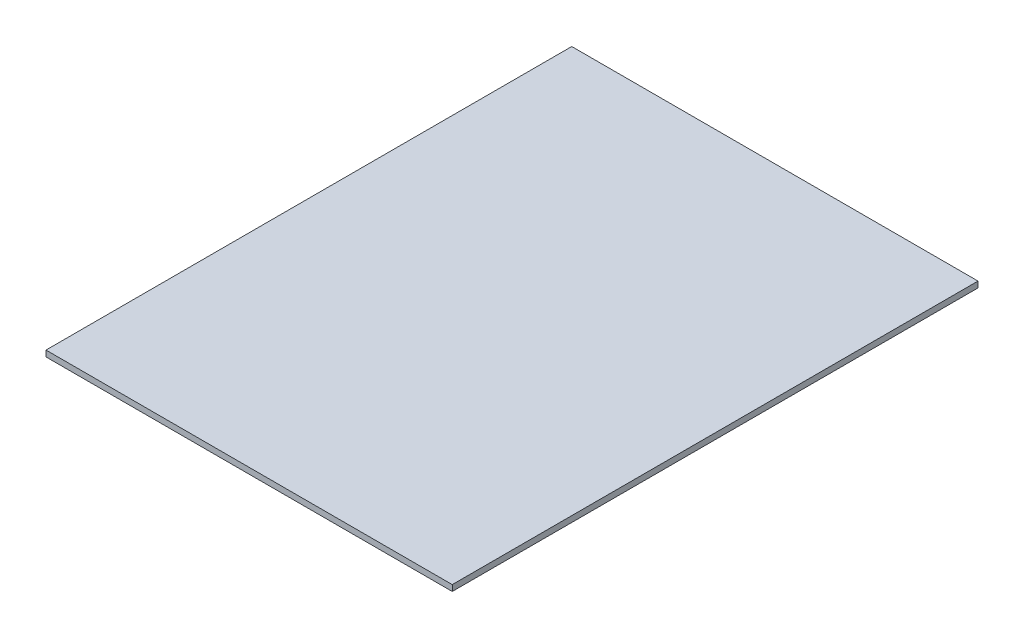
ISO-10303-21;
HEADER;
FILE_DESCRIPTION(('STEP AP214'),'2;1');
FILE_NAME('part.step','',(''),(''),'','','');
FILE_SCHEMA(('AUTOMOTIVE_DESIGN { 1 0 10303 214 1 1 1 1 }'));
ENDSEC;
DATA;
#1=APPLICATION_CONTEXT('core data for automotive mechanical design processes');
#2=APPLICATION_PROTOCOL_DEFINITION('international standard','automotive_design',2000,#1);
#3=PRODUCT_CONTEXT('',#1,'mechanical');
#4=PRODUCT('Part','Part','',(#3));
#5=PRODUCT_RELATED_PRODUCT_CATEGORY('part','',(#4));
#6=PRODUCT_DEFINITION_FORMATION('','',#4);
#7=PRODUCT_DEFINITION_CONTEXT('part definition',#1,'design');
#8=PRODUCT_DEFINITION('design','',#6,#7);
#9=PRODUCT_DEFINITION_SHAPE('','',#8);
#10=(LENGTH_UNIT() NAMED_UNIT(*) SI_UNIT(.MILLI.,.METRE.));
#11=(NAMED_UNIT(*) PLANE_ANGLE_UNIT() SI_UNIT($,.RADIAN.));
#12=(NAMED_UNIT(*) SI_UNIT($,.STERADIAN.) SOLID_ANGLE_UNIT());
#13=UNCERTAINTY_MEASURE_WITH_UNIT(LENGTH_MEASURE(1.E-05),#10,'distance_accuracy_value','');
#14=(GEOMETRIC_REPRESENTATION_CONTEXT(3) GLOBAL_UNCERTAINTY_ASSIGNED_CONTEXT((#13)) GLOBAL_UNIT_ASSIGNED_CONTEXT((#10,
#11,#12)) REPRESENTATION_CONTEXT('',''));
#15=CARTESIAN_POINT('',(0.,0.,0.));
#16=DIRECTION('',(0.,0.,1.));
#17=DIRECTION('',(1.,0.,0.));
#18=AXIS2_PLACEMENT_3D('',#15,#16,#17);
#19=CARTESIAN_POINT('',(0.,3.175,-279.4));
#20=DIRECTION('',(1.,0.,0.));
#21=DIRECTION('',(0.,0.,-1.));
#22=AXIS2_PLACEMENT_3D('',#19,#20,#21);
#23=PLANE('',#22);
#24=DIRECTION('',(0.,0.,1.));
#25=VECTOR('',#24,1.);
#26=CARTESIAN_POINT('',(0.,0.,-279.4));
#27=LINE('',#26,#25);
#28=CARTESIAN_POINT('',(0.,0.,-279.4));
#29=VERTEX_POINT('',#28);
#30=CARTESIAN_POINT('',(0.,0.,0.));
#31=VERTEX_POINT('',#30);
#32=EDGE_CURVE('E107',#29,#31,#27,.T.);
#33=ORIENTED_EDGE('',*,*,#32,.T.);
#34=DIRECTION('',(0.,-1.,0.));
#35=VECTOR('',#34,1.);
#36=CARTESIAN_POINT('',(0.,3.175,0.));
#37=LINE('',#36,#35);
#38=CARTESIAN_POINT('',(0.,3.175,0.));
#39=VERTEX_POINT('',#38);
#40=EDGE_CURVE('E11',#39,#31,#37,.T.);
#41=ORIENTED_EDGE('',*,*,#40,.F.);
#42=DIRECTION('',(0.,0.,1.));
#43=VECTOR('',#42,1.);
#44=CARTESIAN_POINT('',(0.,3.175,-279.4));
#45=LINE('',#44,#43);
#46=CARTESIAN_POINT('',(0.,3.175,-279.4));
#47=VERTEX_POINT('',#46);
#48=EDGE_CURVE('E91',#47,#39,#45,.T.);
#49=ORIENTED_EDGE('',*,*,#48,.F.);
#50=DIRECTION('',(0.,-1.,0.));
#51=VECTOR('',#50,1.);
#52=CARTESIAN_POINT('',(0.,3.175,-279.4));
#53=LINE('',#52,#51);
#54=EDGE_CURVE('E103',#47,#29,#53,.T.);
#55=ORIENTED_EDGE('',*,*,#54,.T.);
#56=EDGE_LOOP('',(#33,#41,#49,#55));
#57=FACE_BOUND('',#56,.T.);
#58=ADVANCED_FACE('F39',(#57),#23,.F.);
#59=CARTESIAN_POINT('',(0.,3.175,0.));
#60=DIRECTION('',(0.,0.,-1.));
#61=DIRECTION('',(-1.,0.,0.));
#62=AXIS2_PLACEMENT_3D('',#59,#60,#61);
#63=PLANE('',#62);
#64=DIRECTION('',(1.,0.,0.));
#65=VECTOR('',#64,1.);
#66=CARTESIAN_POINT('',(0.,0.,0.));
#67=LINE('',#66,#65);
#68=CARTESIAN_POINT('',(215.9,0.,0.));
#69=VERTEX_POINT('',#68);
#70=EDGE_CURVE('E96',#31,#69,#67,.T.);
#71=ORIENTED_EDGE('',*,*,#70,.T.);
#72=DIRECTION('',(0.,-1.,0.));
#73=VECTOR('',#72,1.);
#74=CARTESIAN_POINT('',(215.9,3.175,0.));
#75=LINE('',#74,#73);
#76=CARTESIAN_POINT('',(215.9,3.175,0.));
#77=VERTEX_POINT('',#76);
#78=EDGE_CURVE('E48',#77,#69,#75,.T.);
#79=ORIENTED_EDGE('',*,*,#78,.F.);
#80=DIRECTION('',(1.,0.,0.));
#81=VECTOR('',#80,1.);
#82=CARTESIAN_POINT('',(0.,3.175,0.));
#83=LINE('',#82,#81);
#84=EDGE_CURVE('E86',#39,#77,#83,.T.);
#85=ORIENTED_EDGE('',*,*,#84,.F.);
#86=ORIENTED_EDGE('',*,*,#40,.T.);
#87=EDGE_LOOP('',(#71,#79,#85,#86));
#88=FACE_BOUND('',#87,.T.);
#89=ADVANCED_FACE('F95',(#88),#63,.F.);
#90=CARTESIAN_POINT('',(215.9,3.175,0.));
#91=DIRECTION('',(-1.,0.,0.));
#92=DIRECTION('',(0.,0.,1.));
#93=AXIS2_PLACEMENT_3D('',#90,#91,#92);
#94=PLANE('',#93);
#95=DIRECTION('',(0.,0.,-1.));
#96=VECTOR('',#95,1.);
#97=CARTESIAN_POINT('',(215.9,0.,0.));
#98=LINE('',#97,#96);
#99=CARTESIAN_POINT('',(215.9,0.,-279.4));
#100=VERTEX_POINT('',#99);
#101=EDGE_CURVE('E73',#69,#100,#98,.T.);
#102=ORIENTED_EDGE('',*,*,#101,.T.);
#103=DIRECTION('',(0.,-1.,0.));
#104=VECTOR('',#103,1.);
#105=CARTESIAN_POINT('',(215.9,3.175,-279.4));
#106=LINE('',#105,#104);
#107=CARTESIAN_POINT('',(215.9,3.175,-279.4));
#108=VERTEX_POINT('',#107);
#109=EDGE_CURVE('E98',#108,#100,#106,.T.);
#110=ORIENTED_EDGE('',*,*,#109,.F.);
#111=DIRECTION('',(0.,0.,-1.));
#112=VECTOR('',#111,1.);
#113=CARTESIAN_POINT('',(215.9,3.175,0.));
#114=LINE('',#113,#112);
#115=EDGE_CURVE('E89',#77,#108,#114,.T.);
#116=ORIENTED_EDGE('',*,*,#115,.F.);
#117=ORIENTED_EDGE('',*,*,#78,.T.);
#118=EDGE_LOOP('',(#102,#110,#116,#117));
#119=FACE_BOUND('',#118,.T.);
#120=ADVANCED_FACE('F99',(#119),#94,.F.);
#121=CARTESIAN_POINT('',(215.9,3.175,-279.4));
#122=DIRECTION('',(0.,0.,1.));
#123=DIRECTION('',(1.,0.,0.));
#124=AXIS2_PLACEMENT_3D('',#121,#122,#123);
#125=PLANE('',#124);
#126=DIRECTION('',(-1.,0.,0.));
#127=VECTOR('',#126,1.);
#128=CARTESIAN_POINT('',(215.9,0.,-279.4));
#129=LINE('',#128,#127);
#130=EDGE_CURVE('E79',#100,#29,#129,.T.);
#131=ORIENTED_EDGE('',*,*,#130,.T.);
#132=ORIENTED_EDGE('',*,*,#54,.F.);
#133=DIRECTION('',(-1.,0.,0.));
#134=VECTOR('',#133,1.);
#135=CARTESIAN_POINT('',(215.9,3.175,-279.4));
#136=LINE('',#135,#134);
#137=EDGE_CURVE('E56',#108,#47,#136,.T.);
#138=ORIENTED_EDGE('',*,*,#137,.F.);
#139=ORIENTED_EDGE('',*,*,#109,.T.);
#140=EDGE_LOOP('',(#131,#132,#138,#139));
#141=FACE_BOUND('',#140,.T.);
#142=ADVANCED_FACE('F120',(#141),#125,.F.);
#143=CARTESIAN_POINT('',(0.,3.175,0.));
#144=DIRECTION('',(0.,1.,0.));
#145=DIRECTION('',(0.,0.,1.));
#146=AXIS2_PLACEMENT_3D('',#143,#144,#145);
#147=PLANE('',#146);
#148=ORIENTED_EDGE('',*,*,#48,.T.);
#149=ORIENTED_EDGE('',*,*,#84,.T.);
#150=ORIENTED_EDGE('',*,*,#115,.T.);
#151=ORIENTED_EDGE('',*,*,#137,.T.);
#152=EDGE_LOOP('',(#148,#149,#150,#151));
#153=FACE_BOUND('',#152,.T.);
#154=ADVANCED_FACE('F87',(#153),#147,.T.);
#155=CARTESIAN_POINT('',(0.,0.,0.));
#156=DIRECTION('',(0.,1.,0.));
#157=DIRECTION('',(0.,0.,1.));
#158=AXIS2_PLACEMENT_3D('',#155,#156,#157);
#159=PLANE('',#158);
#160=ORIENTED_EDGE('',*,*,#32,.F.);
#161=ORIENTED_EDGE('',*,*,#130,.F.);
#162=ORIENTED_EDGE('',*,*,#101,.F.);
#163=ORIENTED_EDGE('',*,*,#70,.F.);
#164=EDGE_LOOP('',(#160,#161,#162,#163));
#165=FACE_BOUND('',#164,.T.);
#166=ADVANCED_FACE('F123',(#165),#159,.F.);
#167=CLOSED_SHELL('',(#58,#89,#120,#142,#154,#166));
#168=MANIFOLD_SOLID_BREP('B2',#167);
#169=ADVANCED_BREP_SHAPE_REPRESENTATION('',(#18,#168),#14);
#170=SHAPE_DEFINITION_REPRESENTATION(#9,#169);
ENDSEC;
END-ISO-10303-21;
